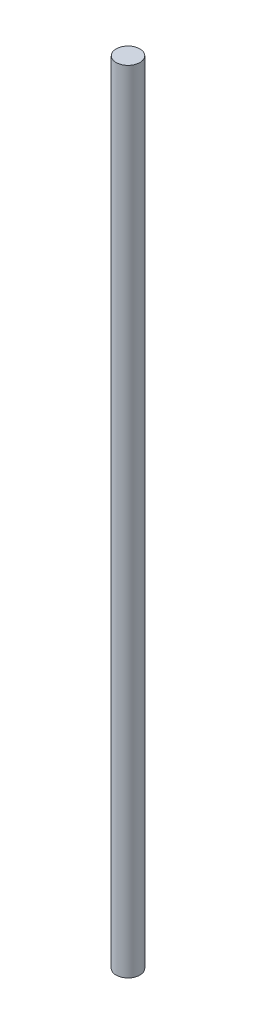
ISO-10303-21;
HEADER;
FILE_DESCRIPTION(('STEP AP214'),'2;1');
FILE_NAME('part.step','',(''),(''),'','','');
FILE_SCHEMA(('AUTOMOTIVE_DESIGN { 1 0 10303 214 1 1 1 1 }'));
ENDSEC;
DATA;
#1=APPLICATION_CONTEXT('core data for automotive mechanical design processes');
#2=APPLICATION_PROTOCOL_DEFINITION('international standard','automotive_design',2000,#1);
#3=PRODUCT_CONTEXT('',#1,'mechanical');
#4=PRODUCT('Part','Part','',(#3));
#5=PRODUCT_RELATED_PRODUCT_CATEGORY('part','',(#4));
#6=PRODUCT_DEFINITION_FORMATION('','',#4);
#7=PRODUCT_DEFINITION_CONTEXT('part definition',#1,'design');
#8=PRODUCT_DEFINITION('design','',#6,#7);
#9=PRODUCT_DEFINITION_SHAPE('','',#8);
#10=(LENGTH_UNIT() NAMED_UNIT(*) SI_UNIT(.MILLI.,.METRE.));
#11=(NAMED_UNIT(*) PLANE_ANGLE_UNIT() SI_UNIT($,.RADIAN.));
#12=(NAMED_UNIT(*) SI_UNIT($,.STERADIAN.) SOLID_ANGLE_UNIT());
#13=UNCERTAINTY_MEASURE_WITH_UNIT(LENGTH_MEASURE(1.E-05),#10,'distance_accuracy_value','');
#14=(GEOMETRIC_REPRESENTATION_CONTEXT(3) GLOBAL_UNCERTAINTY_ASSIGNED_CONTEXT((#13)) GLOBAL_UNIT_ASSIGNED_CONTEXT((#10,
#11,#12)) REPRESENTATION_CONTEXT('',''));
#15=CARTESIAN_POINT('',(0.,0.,0.));
#16=DIRECTION('',(0.,0.,1.));
#17=DIRECTION('',(1.,0.,0.));
#18=AXIS2_PLACEMENT_3D('',#15,#16,#17);
#19=CARTESIAN_POINT('',(0.,200.,0.));
#20=DIRECTION('',(0.,-1.,0.));
#21=DIRECTION('',(0.,0.,-1.));
#22=AXIS2_PLACEMENT_3D('',#19,#20,#21);
#23=CYLINDRICAL_SURFACE('',#22,3.);
#24=CARTESIAN_POINT('',(0.,200.,0.));
#25=DIRECTION('',(0.,1.,0.));
#26=DIRECTION('',(0.,0.,1.));
#27=AXIS2_PLACEMENT_3D('',#24,#25,#26);
#28=CIRCLE('',#27,3.);
#29=CARTESIAN_POINT('',(0.,200.,3.));
#30=VERTEX_POINT('',#29);
#31=EDGE_CURVE('E10',#30,#30,#28,.T.);
#32=ORIENTED_EDGE('',*,*,#31,.F.);
#33=EDGE_LOOP('',(#32));
#34=FACE_BOUND('',#33,.T.);
#35=CARTESIAN_POINT('',(0.,0.,0.));
#36=DIRECTION('',(0.,1.,0.));
#37=DIRECTION('',(0.,0.,1.));
#38=AXIS2_PLACEMENT_3D('',#35,#36,#37);
#39=CIRCLE('',#38,3.);
#40=CARTESIAN_POINT('',(0.,0.,3.));
#41=VERTEX_POINT('',#40);
#42=EDGE_CURVE('E31',#41,#41,#39,.T.);
#43=ORIENTED_EDGE('',*,*,#42,.T.);
#44=EDGE_LOOP('',(#43));
#45=FACE_BOUND('',#44,.T.);
#46=ADVANCED_FACE('F28',(#34,#45),#23,.T.);
#47=CARTESIAN_POINT('',(0.,200.,0.));
#48=DIRECTION('',(0.,1.,0.));
#49=DIRECTION('',(0.,0.,1.));
#50=AXIS2_PLACEMENT_3D('',#47,#48,#49);
#51=PLANE('',#50);
#52=ORIENTED_EDGE('',*,*,#31,.T.);
#53=EDGE_LOOP('',(#52));
#54=FACE_BOUND('',#53,.T.);
#55=ADVANCED_FACE('F43',(#54),#51,.T.);
#56=CARTESIAN_POINT('',(0.,0.,0.));
#57=DIRECTION('',(0.,1.,0.));
#58=DIRECTION('',(0.,0.,1.));
#59=AXIS2_PLACEMENT_3D('',#56,#57,#58);
#60=PLANE('',#59);
#61=ORIENTED_EDGE('',*,*,#42,.F.);
#62=EDGE_LOOP('',(#61));
#63=FACE_BOUND('',#62,.T.);
#64=ADVANCED_FACE('F41',(#63),#60,.F.);
#65=CLOSED_SHELL('',(#46,#55,#64));
#66=MANIFOLD_SOLID_BREP('B2',#65);
#67=ADVANCED_BREP_SHAPE_REPRESENTATION('',(#18,#66),#14);
#68=SHAPE_DEFINITION_REPRESENTATION(#9,#67);
ENDSEC;
END-ISO-10303-21;
